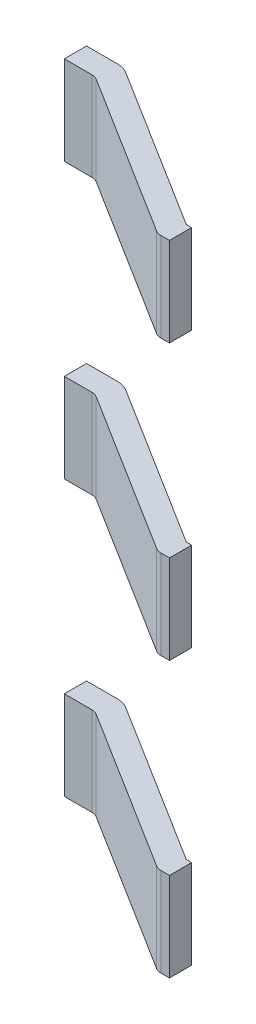
ISO-10303-21;
HEADER;
FILE_DESCRIPTION(('STEP AP214'),'2;1');
FILE_NAME('part.step','',(''),(''),'','','');
FILE_SCHEMA(('AUTOMOTIVE_DESIGN { 1 0 10303 214 1 1 1 1 }'));
ENDSEC;
DATA;
#1=APPLICATION_CONTEXT('core data for automotive mechanical design processes');
#2=APPLICATION_PROTOCOL_DEFINITION('international standard','automotive_design',2000,#1);
#3=PRODUCT_CONTEXT('',#1,'mechanical');
#4=PRODUCT('Part','Part','',(#3));
#5=PRODUCT_RELATED_PRODUCT_CATEGORY('part','',(#4));
#6=PRODUCT_DEFINITION_FORMATION('','',#4);
#7=PRODUCT_DEFINITION_CONTEXT('part definition',#1,'design');
#8=PRODUCT_DEFINITION('design','',#6,#7);
#9=PRODUCT_DEFINITION_SHAPE('','',#8);
#10=(LENGTH_UNIT() NAMED_UNIT(*) SI_UNIT(.MILLI.,.METRE.));
#11=(NAMED_UNIT(*) PLANE_ANGLE_UNIT() SI_UNIT($,.RADIAN.));
#12=(NAMED_UNIT(*) SI_UNIT($,.STERADIAN.) SOLID_ANGLE_UNIT());
#13=UNCERTAINTY_MEASURE_WITH_UNIT(LENGTH_MEASURE(1.E-05),#10,'distance_accuracy_value','');
#14=(GEOMETRIC_REPRESENTATION_CONTEXT(3) GLOBAL_UNCERTAINTY_ASSIGNED_CONTEXT((#13)) GLOBAL_UNIT_ASSIGNED_CONTEXT((#10,
#11,#12)) REPRESENTATION_CONTEXT('',''));
#15=CARTESIAN_POINT('',(0.,0.,0.));
#16=DIRECTION('',(0.,0.,1.));
#17=DIRECTION('',(1.,0.,0.));
#18=AXIS2_PLACEMENT_3D('',#15,#16,#17);
#19=CARTESIAN_POINT('',(-1.824104576066,1.92,0.964303036979));
#20=DIRECTION('',(0.,1.,0.));
#21=DIRECTION('',(-0.530661276733133,0.,0.847583983671212));
#22=AXIS2_PLACEMENT_3D('',#19,#20,#21);
#23=CYLINDRICAL_SURFACE('',#22,0.0925);
#24=CARTESIAN_POINT('',(-1.824104576066,1.92,0.964303036979));
#25=DIRECTION('',(0.,1.,0.));
#26=DIRECTION('',(0.,0.,1.));
#27=AXIS2_PLACEMENT_3D('',#24,#25,#26);
#28=CIRCLE('',#27,0.0925);
#29=CARTESIAN_POINT('',(-1.873190744164,1.92,1.042704555469));
#30=VERTEX_POINT('',#29);
#31=CARTESIAN_POINT('',(-1.824104576066,1.92,1.056803036979));
#32=VERTEX_POINT('',#31);
#33=EDGE_CURVE('P0_E228',#30,#32,#28,.T.);
#34=ORIENTED_EDGE('',*,*,#33,.T.);
#35=DIRECTION('',(0.,1.,0.));
#36=VECTOR('',#35,1.);
#37=CARTESIAN_POINT('',(-1.824104576066,1.92,1.056803036979));
#38=LINE('',#37,#36);
#39=CARTESIAN_POINT('',(-1.824104576066,2.66,1.056803036979));
#40=VERTEX_POINT('',#39);
#41=EDGE_CURVE('P0_E11',#32,#40,#38,.T.);
#42=ORIENTED_EDGE('',*,*,#41,.T.);
#43=CARTESIAN_POINT('',(-1.824104576066,2.66,0.964303036979));
#44=DIRECTION('',(0.,1.,0.));
#45=DIRECTION('',(0.,0.,1.));
#46=AXIS2_PLACEMENT_3D('',#43,#44,#45);
#47=CIRCLE('',#46,0.0925);
#48=CARTESIAN_POINT('',(-1.873190744164,2.66,1.042704555469));
#49=VERTEX_POINT('',#48);
#50=EDGE_CURVE('P0_E179',#49,#40,#47,.T.);
#51=ORIENTED_EDGE('',*,*,#50,.F.);
#52=DIRECTION('',(0.,1.,0.));
#53=VECTOR('',#52,1.);
#54=CARTESIAN_POINT('',(-1.873190744164,1.92,1.042704555469));
#55=LINE('',#54,#53);
#56=EDGE_CURVE('P0_E26',#30,#49,#55,.T.);
#57=ORIENTED_EDGE('',*,*,#56,.F.);
#58=EDGE_LOOP('',(#34,#42,#51,#57));
#59=FACE_BOUND('',#58,.T.);
#60=ADVANCED_FACE('P0_F17',(#59),#23,.T.);
#61=CARTESIAN_POINT('',(-1.850672336196,1.92,1.056803036979));
#62=DIRECTION('',(0.,0.,1.));
#63=DIRECTION('',(1.,0.,0.));
#64=AXIS2_PLACEMENT_3D('',#61,#62,#63);
#65=PLANE('',#64);
#66=DIRECTION('',(1.,0.,0.));
#67=VECTOR('',#66,1.);
#68=CARTESIAN_POINT('',(-1.850672336196,1.92,1.056803036979));
#69=LINE('',#68,#67);
#70=CARTESIAN_POINT('',(-1.7525,1.92,1.056803036979));
#71=VERTEX_POINT('',#70);
#72=EDGE_CURVE('P0_E227',#32,#71,#69,.T.);
#73=ORIENTED_EDGE('',*,*,#72,.T.);
#74=DIRECTION('',(0.,1.,0.));
#75=VECTOR('',#74,1.);
#76=CARTESIAN_POINT('',(-1.7525,1.92,1.056803036979));
#77=LINE('',#76,#75);
#78=CARTESIAN_POINT('',(-1.7525,2.66,1.056803036979));
#79=VERTEX_POINT('',#78);
#80=EDGE_CURVE('P0_E196',#71,#79,#77,.T.);
#81=ORIENTED_EDGE('',*,*,#80,.T.);
#82=DIRECTION('',(1.,0.,0.));
#83=VECTOR('',#82,1.);
#84=CARTESIAN_POINT('',(-1.850672336196,2.66,1.056803036979));
#85=LINE('',#84,#83);
#86=EDGE_CURVE('P0_E188',#40,#79,#85,.T.);
#87=ORIENTED_EDGE('',*,*,#86,.F.);
#88=ORIENTED_EDGE('',*,*,#41,.F.);
#89=EDGE_LOOP('',(#73,#81,#87,#88));
#90=FACE_BOUND('',#89,.T.);
#91=ADVANCED_FACE('P0_F19',(#90),#65,.T.);
#92=CARTESIAN_POINT('',(-3.288172336196,1.92,0.156803036979));
#93=DIRECTION('',(0.530661276733133,0.,-0.847583983671212));
#94=DIRECTION('',(0.,-1.,0.));
#95=AXIS2_PLACEMENT_3D('',#92,#93,#94);
#96=PLANE('',#95);
#97=ORIENTED_EDGE('',*,*,#56,.T.);
#98=DIRECTION('',(0.847583983671212,0.,0.530661276733133));
#99=VECTOR('',#98,1.);
#100=CARTESIAN_POINT('',(-3.288172336196,2.66,0.156803036979));
#101=LINE('',#100,#99);
#102=CARTESIAN_POINT('',(-3.220617112292,2.66,0.19909848151));
#103=VERTEX_POINT('',#102);
#104=EDGE_CURVE('P0_E175',#103,#49,#101,.T.);
#105=ORIENTED_EDGE('',*,*,#104,.F.);
#106=DIRECTION('',(0.,1.,0.));
#107=VECTOR('',#106,1.);
#108=CARTESIAN_POINT('',(-3.220617112292,1.92,0.19909848151));
#109=LINE('',#108,#107);
#110=CARTESIAN_POINT('',(-3.220617112292,1.92,0.19909848151));
#111=VERTEX_POINT('',#110);
#112=EDGE_CURVE('P0_E170',#111,#103,#109,.T.);
#113=ORIENTED_EDGE('',*,*,#112,.F.);
#114=DIRECTION('',(0.847583983671212,0.,0.530661276733133));
#115=VECTOR('',#114,1.);
#116=CARTESIAN_POINT('',(-3.288172336196,1.92,0.156803036979));
#117=LINE('',#116,#115);
#118=EDGE_CURVE('P0_E139',#111,#30,#117,.T.);
#119=ORIENTED_EDGE('',*,*,#118,.T.);
#120=EDGE_LOOP('',(#97,#105,#113,#119));
#121=FACE_BOUND('',#120,.T.);
#122=ADVANCED_FACE('P0_F281',(#121),#96,.F.);
#123=CARTESIAN_POINT('',(-1.7525,1.92,0.871803036979));
#124=DIRECTION('',(1.,0.,0.));
#125=DIRECTION('',(0.,1.,0.));
#126=AXIS2_PLACEMENT_3D('',#123,#124,#125);
#127=PLANE('',#126);
#128=DIRECTION('',(0.,0.,1.));
#129=VECTOR('',#128,1.);
#130=CARTESIAN_POINT('',(-1.7525,1.92,0.871803036979));
#131=LINE('',#130,#129);
#132=CARTESIAN_POINT('',(-1.7525,1.92,0.871803036979));
#133=VERTEX_POINT('',#132);
#134=EDGE_CURVE('P0_E223',#133,#71,#131,.T.);
#135=ORIENTED_EDGE('',*,*,#134,.F.);
#136=DIRECTION('',(0.,1.,0.));
#137=VECTOR('',#136,1.);
#138=CARTESIAN_POINT('',(-1.7525,1.92,0.871803036979));
#139=LINE('',#138,#137);
#140=CARTESIAN_POINT('',(-1.7525,2.66,0.871803036979));
#141=VERTEX_POINT('',#140);
#142=EDGE_CURVE('P0_E212',#133,#141,#139,.T.);
#143=ORIENTED_EDGE('',*,*,#142,.T.);
#144=DIRECTION('',(0.,0.,1.));
#145=VECTOR('',#144,1.);
#146=CARTESIAN_POINT('',(-1.7525,2.66,0.871803036979));
#147=LINE('',#146,#145);
#148=EDGE_CURVE('P0_E184',#141,#79,#147,.T.);
#149=ORIENTED_EDGE('',*,*,#148,.T.);
#150=ORIENTED_EDGE('',*,*,#80,.F.);
#151=EDGE_LOOP('',(#135,#143,#149,#150));
#152=FACE_BOUND('',#151,.T.);
#153=ADVANCED_FACE('P0_F243',(#152),#127,.T.);
#154=CARTESIAN_POINT('',(-1.850672336196,1.92,0.871803036979));
#155=DIRECTION('',(0.,0.,1.));
#156=DIRECTION('',(1.,0.,0.));
#157=AXIS2_PLACEMENT_3D('',#154,#155,#156);
#158=PLANE('',#157);
#159=ORIENTED_EDGE('',*,*,#142,.F.);
#160=DIRECTION('',(1.,0.,0.));
#161=VECTOR('',#160,1.);
#162=CARTESIAN_POINT('',(-1.850672336196,1.92,0.871803036979));
#163=LINE('',#162,#161);
#164=CARTESIAN_POINT('',(-1.797536815936,1.92,0.871803036979));
#165=VERTEX_POINT('',#164);
#166=EDGE_CURVE('P0_E219',#165,#133,#163,.T.);
#167=ORIENTED_EDGE('',*,*,#166,.F.);
#168=DIRECTION('',(0.,1.,0.));
#169=VECTOR('',#168,1.);
#170=CARTESIAN_POINT('',(-1.797536815936,1.92,0.871803036979));
#171=LINE('',#170,#169);
#172=CARTESIAN_POINT('',(-1.797536815936,2.66,0.871803036979));
#173=VERTEX_POINT('',#172);
#174=EDGE_CURVE('P0_E209',#165,#173,#171,.T.);
#175=ORIENTED_EDGE('',*,*,#174,.T.);
#176=DIRECTION('',(1.,0.,0.));
#177=VECTOR('',#176,1.);
#178=CARTESIAN_POINT('',(-1.850672336196,2.66,0.871803036979));
#179=LINE('',#178,#177);
#180=EDGE_CURVE('P0_E180',#173,#141,#179,.T.);
#181=ORIENTED_EDGE('',*,*,#180,.T.);
#182=EDGE_LOOP('',(#159,#167,#175,#181));
#183=FACE_BOUND('',#182,.T.);
#184=ADVANCED_FACE('P0_F362',(#183),#158,.F.);
#185=CARTESIAN_POINT('',(-3.19,1.92,0.));
#186=DIRECTION('',(0.530661276733133,0.,-0.847583983671212));
#187=DIRECTION('',(0.,-1.,0.));
#188=AXIS2_PLACEMENT_3D('',#185,#186,#187);
#189=PLANE('',#188);
#190=DIRECTION('',(0.847583983671212,0.,0.530661276733133));
#191=VECTOR('',#190,1.);
#192=CARTESIAN_POINT('',(-3.19,1.92,0.));
#193=LINE('',#192,#191);
#194=CARTESIAN_POINT('',(-3.144963184064,1.92,0.02819696302084));
#195=VERTEX_POINT('',#194);
#196=EDGE_CURVE('P0_E215',#195,#165,#193,.T.);
#197=ORIENTED_EDGE('',*,*,#196,.F.);
#198=DIRECTION('',(0.,1.,0.));
#199=VECTOR('',#198,1.);
#200=CARTESIAN_POINT('',(-3.144963184064,1.92,0.02819696302084));
#201=LINE('',#200,#199);
#202=CARTESIAN_POINT('',(-3.144963184064,2.66,0.02819696302084));
#203=VERTEX_POINT('',#202);
#204=EDGE_CURVE('P0_E138',#195,#203,#201,.T.);
#205=ORIENTED_EDGE('',*,*,#204,.T.);
#206=DIRECTION('',(0.847583983671212,0.,0.530661276733133));
#207=VECTOR('',#206,1.);
#208=CARTESIAN_POINT('',(-3.19,2.66,0.));
#209=LINE('',#208,#207);
#210=EDGE_CURVE('P0_E147',#203,#173,#209,.T.);
#211=ORIENTED_EDGE('',*,*,#210,.T.);
#212=ORIENTED_EDGE('',*,*,#174,.F.);
#213=EDGE_LOOP('',(#197,#205,#211,#212));
#214=FACE_BOUND('',#213,.T.);
#215=ADVANCED_FACE('P0_F352',(#214),#189,.T.);
#216=CARTESIAN_POINT('',(-3.24313552026,1.92,0.185));
#217=DIRECTION('',(0.,1.,0.));
#218=DIRECTION('',(0.,0.,-1.));
#219=AXIS2_PLACEMENT_3D('',#216,#217,#218);
#220=CYLINDRICAL_SURFACE('',#219,0.185);
#221=DIRECTION('',(0.,1.,0.));
#222=VECTOR('',#221,1.);
#223=CARTESIAN_POINT('',(-3.24313552026,1.92,0.));
#224=LINE('',#223,#222);
#225=CARTESIAN_POINT('',(-3.24313552026,1.92,0.));
#226=VERTEX_POINT('',#225);
#227=CARTESIAN_POINT('',(-3.24313552026,2.66,0.));
#228=VERTEX_POINT('',#227);
#229=EDGE_CURVE('P0_E127',#226,#228,#224,.T.);
#230=ORIENTED_EDGE('',*,*,#229,.T.);
#231=CARTESIAN_POINT('',(-3.24313552026,2.66,0.185));
#232=DIRECTION('',(0.,-1.,0.));
#233=DIRECTION('',(0.,0.,1.));
#234=AXIS2_PLACEMENT_3D('',#231,#232,#233);
#235=CIRCLE('',#234,0.185);
#236=EDGE_CURVE('P0_E130',#228,#203,#235,.T.);
#237=ORIENTED_EDGE('',*,*,#236,.T.);
#238=ORIENTED_EDGE('',*,*,#204,.F.);
#239=CARTESIAN_POINT('',(-3.24313552026,1.92,0.185));
#240=DIRECTION('',(0.,-1.,0.));
#241=DIRECTION('',(0.,0.,1.));
#242=AXIS2_PLACEMENT_3D('',#239,#240,#241);
#243=CIRCLE('',#242,0.185);
#244=EDGE_CURVE('P0_E133',#226,#195,#243,.T.);
#245=ORIENTED_EDGE('',*,*,#244,.F.);
#246=EDGE_LOOP('',(#230,#237,#238,#245));
#247=FACE_BOUND('',#246,.T.);
#248=ADVANCED_FACE('P0_F129',(#247),#220,.T.);
#249=CARTESIAN_POINT('',(-3.5,1.92,0.));
#250=DIRECTION('',(0.,0.,1.));
#251=DIRECTION('',(1.,0.,0.));
#252=AXIS2_PLACEMENT_3D('',#249,#250,#251);
#253=PLANE('',#252);
#254=ORIENTED_EDGE('',*,*,#229,.F.);
#255=DIRECTION('',(1.,0.,0.));
#256=VECTOR('',#255,1.);
#257=CARTESIAN_POINT('',(-3.5,1.92,0.));
#258=LINE('',#257,#256);
#259=CARTESIAN_POINT('',(-3.5,1.92,0.));
#260=VERTEX_POINT('',#259);
#261=EDGE_CURVE('P0_E208',#260,#226,#258,.T.);
#262=ORIENTED_EDGE('',*,*,#261,.F.);
#263=DIRECTION('',(0.,1.,0.));
#264=VECTOR('',#263,1.);
#265=CARTESIAN_POINT('',(-3.5,1.92,0.));
#266=LINE('',#265,#264);
#267=CARTESIAN_POINT('',(-3.5,2.66,0.));
#268=VERTEX_POINT('',#267);
#269=EDGE_CURVE('P0_E153',#260,#268,#266,.T.);
#270=ORIENTED_EDGE('',*,*,#269,.T.);
#271=DIRECTION('',(1.,0.,0.));
#272=VECTOR('',#271,1.);
#273=CARTESIAN_POINT('',(-3.5,2.66,0.));
#274=LINE('',#273,#272);
#275=EDGE_CURVE('P0_E144',#268,#228,#274,.T.);
#276=ORIENTED_EDGE('',*,*,#275,.T.);
#277=EDGE_LOOP('',(#254,#262,#270,#276));
#278=FACE_BOUND('',#277,.T.);
#279=ADVANCED_FACE('P0_F151',(#278),#253,.F.);
#280=CARTESIAN_POINT('',(-2.614100714426,1.92,0.486101794686));
#281=DIRECTION('',(0.,-1.,0.));
#282=DIRECTION('',(0.,0.,-1.));
#283=AXIS2_PLACEMENT_3D('',#280,#281,#282);
#284=PLANE('',#283);
#285=ORIENTED_EDGE('',*,*,#261,.T.);
#286=ORIENTED_EDGE('',*,*,#244,.T.);
#287=ORIENTED_EDGE('',*,*,#196,.T.);
#288=ORIENTED_EDGE('',*,*,#166,.T.);
#289=ORIENTED_EDGE('',*,*,#134,.T.);
#290=ORIENTED_EDGE('',*,*,#72,.F.);
#291=ORIENTED_EDGE('',*,*,#33,.F.);
#292=ORIENTED_EDGE('',*,*,#118,.F.);
#293=CARTESIAN_POINT('',(-3.269703280389,1.92,0.2775));
#294=DIRECTION('',(0.,-1.,0.));
#295=DIRECTION('',(0.,0.,1.));
#296=AXIS2_PLACEMENT_3D('',#293,#294,#295);
#297=CIRCLE('',#296,0.0925);
#298=CARTESIAN_POINT('',(-3.269703280389,1.92,0.185));
#299=VERTEX_POINT('',#298);
#300=EDGE_CURVE('P0_E149',#299,#111,#297,.T.);
#301=ORIENTED_EDGE('',*,*,#300,.F.);
#302=DIRECTION('',(1.,0.,0.));
#303=VECTOR('',#302,1.);
#304=CARTESIAN_POINT('',(-3.5,1.92,0.185));
#305=LINE('',#304,#303);
#306=CARTESIAN_POINT('',(-3.5,1.92,0.185));
#307=VERTEX_POINT('',#306);
#308=EDGE_CURVE('P0_E167',#307,#299,#305,.T.);
#309=ORIENTED_EDGE('',*,*,#308,.F.);
#310=DIRECTION('',(0.,0.,1.));
#311=VECTOR('',#310,1.);
#312=CARTESIAN_POINT('',(-3.5,1.92,0.));
#313=LINE('',#312,#311);
#314=EDGE_CURVE('P0_E205',#260,#307,#313,.T.);
#315=ORIENTED_EDGE('',*,*,#314,.F.);
#316=EDGE_LOOP('',(#285,#286,#287,#288,#289,#290,#291,#292,#301,#309,#315));
#317=FACE_BOUND('',#316,.T.);
#318=ADVANCED_FACE('P0_F247',(#317),#284,.T.);
#319=CARTESIAN_POINT('',(-3.5,1.92,0.));
#320=DIRECTION('',(1.,0.,0.));
#321=DIRECTION('',(0.,1.,0.));
#322=AXIS2_PLACEMENT_3D('',#319,#320,#321);
#323=PLANE('',#322);
#324=DIRECTION('',(0.,1.,0.));
#325=VECTOR('',#324,1.);
#326=CARTESIAN_POINT('',(-3.5,1.92,0.185));
#327=LINE('',#326,#325);
#328=CARTESIAN_POINT('',(-3.5,2.66,0.185));
#329=VERTEX_POINT('',#328);
#330=EDGE_CURVE('P0_E258',#307,#329,#327,.T.);
#331=ORIENTED_EDGE('',*,*,#330,.T.);
#332=DIRECTION('',(0.,0.,1.));
#333=VECTOR('',#332,1.);
#334=CARTESIAN_POINT('',(-3.5,2.66,0.));
#335=LINE('',#334,#333);
#336=EDGE_CURVE('P0_E156',#268,#329,#335,.T.);
#337=ORIENTED_EDGE('',*,*,#336,.F.);
#338=ORIENTED_EDGE('',*,*,#269,.F.);
#339=ORIENTED_EDGE('',*,*,#314,.T.);
#340=EDGE_LOOP('',(#331,#337,#338,#339));
#341=FACE_BOUND('',#340,.T.);
#342=ADVANCED_FACE('P0_F283',(#341),#323,.F.);
#343=CARTESIAN_POINT('',(-3.269703280389,1.92,0.2775));
#344=DIRECTION('',(0.,1.,0.));
#345=DIRECTION('',(0.,0.,-1.));
#346=AXIS2_PLACEMENT_3D('',#343,#344,#345);
#347=CYLINDRICAL_SURFACE('',#346,0.0925);
#348=ORIENTED_EDGE('',*,*,#300,.T.);
#349=ORIENTED_EDGE('',*,*,#112,.T.);
#350=CARTESIAN_POINT('',(-3.269703280389,2.66,0.2775));
#351=DIRECTION('',(0.,-1.,0.));
#352=DIRECTION('',(0.,0.,1.));
#353=AXIS2_PLACEMENT_3D('',#350,#351,#352);
#354=CIRCLE('',#353,0.0925);
#355=CARTESIAN_POINT('',(-3.269703280389,2.66,0.185));
#356=VERTEX_POINT('',#355);
#357=EDGE_CURVE('P0_E164',#356,#103,#354,.T.);
#358=ORIENTED_EDGE('',*,*,#357,.F.);
#359=DIRECTION('',(0.,1.,0.));
#360=VECTOR('',#359,1.);
#361=CARTESIAN_POINT('',(-3.269703280389,1.92,0.185));
#362=LINE('',#361,#360);
#363=EDGE_CURVE('P0_E157',#299,#356,#362,.T.);
#364=ORIENTED_EDGE('',*,*,#363,.F.);
#365=EDGE_LOOP('',(#348,#349,#358,#364));
#366=FACE_BOUND('',#365,.T.);
#367=ADVANCED_FACE('P0_F277',(#366),#347,.F.);
#368=CARTESIAN_POINT('',(-2.614100714426,2.66,0.486101794686));
#369=DIRECTION('',(0.,1.,0.));
#370=DIRECTION('',(0.,0.,-1.));
#371=AXIS2_PLACEMENT_3D('',#368,#369,#370);
#372=PLANE('',#371);
#373=ORIENTED_EDGE('',*,*,#275,.F.);
#374=ORIENTED_EDGE('',*,*,#336,.T.);
#375=DIRECTION('',(1.,0.,0.));
#376=VECTOR('',#375,1.);
#377=CARTESIAN_POINT('',(-3.5,2.66,0.185));
#378=LINE('',#377,#376);
#379=EDGE_CURVE('P0_E254',#329,#356,#378,.T.);
#380=ORIENTED_EDGE('',*,*,#379,.T.);
#381=ORIENTED_EDGE('',*,*,#357,.T.);
#382=ORIENTED_EDGE('',*,*,#104,.T.);
#383=ORIENTED_EDGE('',*,*,#50,.T.);
#384=ORIENTED_EDGE('',*,*,#86,.T.);
#385=ORIENTED_EDGE('',*,*,#148,.F.);
#386=ORIENTED_EDGE('',*,*,#180,.F.);
#387=ORIENTED_EDGE('',*,*,#210,.F.);
#388=ORIENTED_EDGE('',*,*,#236,.F.);
#389=EDGE_LOOP('',(#373,#374,#380,#381,#382,#383,#384,#385,#386,#387,#388));
#390=FACE_BOUND('',#389,.T.);
#391=ADVANCED_FACE('P0_F143',(#390),#372,.T.);
#392=CARTESIAN_POINT('',(-3.5,1.92,0.185));
#393=DIRECTION('',(0.,0.,1.));
#394=DIRECTION('',(1.,0.,0.));
#395=AXIS2_PLACEMENT_3D('',#392,#393,#394);
#396=PLANE('',#395);
#397=ORIENTED_EDGE('',*,*,#379,.F.);
#398=ORIENTED_EDGE('',*,*,#330,.F.);
#399=ORIENTED_EDGE('',*,*,#308,.T.);
#400=ORIENTED_EDGE('',*,*,#363,.T.);
#401=EDGE_LOOP('',(#397,#398,#399,#400));
#402=FACE_BOUND('',#401,.T.);
#403=ADVANCED_FACE('P0_F273',(#402),#396,.T.);
#404=CLOSED_SHELL('',(#60,#91,#122,#153,#184,#215,#248,#279,#318,#342,#367,#391,#403));
#405=MANIFOLD_SOLID_BREP('P0_B1',#404);
#406=CARTESIAN_POINT('',(-1.824104576066,-0.37,0.964303036979));
#407=DIRECTION('',(0.,1.,0.));
#408=DIRECTION('',(-0.530661276733133,0.,0.847583983671212));
#409=AXIS2_PLACEMENT_3D('',#406,#407,#408);
#410=CYLINDRICAL_SURFACE('',#409,0.0925);
#411=CARTESIAN_POINT('',(-1.824104576066,-0.37,0.964303036979));
#412=DIRECTION('',(0.,1.,0.));
#413=DIRECTION('',(0.,0.,1.));
#414=AXIS2_PLACEMENT_3D('',#411,#412,#413);
#415=CIRCLE('',#414,0.0925);
#416=CARTESIAN_POINT('',(-1.873190744164,-0.37,1.042704555469));
#417=VERTEX_POINT('',#416);
#418=CARTESIAN_POINT('',(-1.824104576066,-0.37,1.056803036979));
#419=VERTEX_POINT('',#418);
#420=EDGE_CURVE('P1_E240',#417,#419,#415,.T.);
#421=ORIENTED_EDGE('',*,*,#420,.T.);
#422=DIRECTION('',(0.,1.,0.));
#423=VECTOR('',#422,1.);
#424=CARTESIAN_POINT('',(-1.824104576066,-0.37,1.056803036979));
#425=LINE('',#424,#423);
#426=CARTESIAN_POINT('',(-1.824104576066,0.37,1.056803036979));
#427=VERTEX_POINT('',#426);
#428=EDGE_CURVE('P1_E11',#419,#427,#425,.T.);
#429=ORIENTED_EDGE('',*,*,#428,.T.);
#430=CARTESIAN_POINT('',(-1.824104576066,0.37,0.964303036979));
#431=DIRECTION('',(0.,1.,0.));
#432=DIRECTION('',(0.,0.,1.));
#433=AXIS2_PLACEMENT_3D('',#430,#431,#432);
#434=CIRCLE('',#433,0.0925);
#435=CARTESIAN_POINT('',(-1.873190744164,0.37,1.042704555469));
#436=VERTEX_POINT('',#435);
#437=EDGE_CURVE('P1_E187',#436,#427,#434,.T.);
#438=ORIENTED_EDGE('',*,*,#437,.F.);
#439=DIRECTION('',(0.,1.,0.));
#440=VECTOR('',#439,1.);
#441=CARTESIAN_POINT('',(-1.873190744164,-0.37,1.042704555469));
#442=LINE('',#441,#440);
#443=EDGE_CURVE('P1_E26',#417,#436,#442,.T.);
#444=ORIENTED_EDGE('',*,*,#443,.F.);
#445=EDGE_LOOP('',(#421,#429,#438,#444));
#446=FACE_BOUND('',#445,.T.);
#447=ADVANCED_FACE('P1_F17',(#446),#410,.T.);
#448=CARTESIAN_POINT('',(-1.850672336196,-0.37,1.056803036979));
#449=DIRECTION('',(0.,0.,1.));
#450=DIRECTION('',(1.,0.,0.));
#451=AXIS2_PLACEMENT_3D('',#448,#449,#450);
#452=PLANE('',#451);
#453=DIRECTION('',(1.,0.,0.));
#454=VECTOR('',#453,1.);
#455=CARTESIAN_POINT('',(-1.850672336196,-0.37,1.056803036979));
#456=LINE('',#455,#454);
#457=CARTESIAN_POINT('',(-1.7525,-0.37,1.056803036979));
#458=VERTEX_POINT('',#457);
#459=EDGE_CURVE('P1_E237',#419,#458,#456,.T.);
#460=ORIENTED_EDGE('',*,*,#459,.T.);
#461=DIRECTION('',(0.,1.,0.));
#462=VECTOR('',#461,1.);
#463=CARTESIAN_POINT('',(-1.7525,-0.37,1.056803036979));
#464=LINE('',#463,#462);
#465=CARTESIAN_POINT('',(-1.7525,0.37,1.056803036979));
#466=VERTEX_POINT('',#465);
#467=EDGE_CURVE('P1_E204',#458,#466,#464,.T.);
#468=ORIENTED_EDGE('',*,*,#467,.T.);
#469=DIRECTION('',(1.,0.,0.));
#470=VECTOR('',#469,1.);
#471=CARTESIAN_POINT('',(-1.850672336196,0.37,1.056803036979));
#472=LINE('',#471,#470);
#473=EDGE_CURVE('P1_E201',#427,#466,#472,.T.);
#474=ORIENTED_EDGE('',*,*,#473,.F.);
#475=ORIENTED_EDGE('',*,*,#428,.F.);
#476=EDGE_LOOP('',(#460,#468,#474,#475));
#477=FACE_BOUND('',#476,.T.);
#478=ADVANCED_FACE('P1_F19',(#477),#452,.T.);
#479=CARTESIAN_POINT('',(-3.288172336196,-0.37,0.156803036979));
#480=DIRECTION('',(0.530661276733133,0.,-0.847583983671212));
#481=DIRECTION('',(0.,-1.,0.));
#482=AXIS2_PLACEMENT_3D('',#479,#480,#481);
#483=PLANE('',#482);
#484=ORIENTED_EDGE('',*,*,#443,.T.);
#485=DIRECTION('',(0.847583983671212,0.,0.530661276733133));
#486=VECTOR('',#485,1.);
#487=CARTESIAN_POINT('',(-3.288172336196,0.37,0.156803036979));
#488=LINE('',#487,#486);
#489=CARTESIAN_POINT('',(-3.220617112292,0.37,0.19909848151));
#490=VERTEX_POINT('',#489);
#491=EDGE_CURVE('P1_E179',#490,#436,#488,.T.);
#492=ORIENTED_EDGE('',*,*,#491,.F.);
#493=DIRECTION('',(0.,1.,0.));
#494=VECTOR('',#493,1.);
#495=CARTESIAN_POINT('',(-3.220617112292,-0.37,0.19909848151));
#496=LINE('',#495,#494);
#497=CARTESIAN_POINT('',(-3.220617112292,-0.37,0.19909848151));
#498=VERTEX_POINT('',#497);
#499=EDGE_CURVE('P1_E197',#498,#490,#496,.T.);
#500=ORIENTED_EDGE('',*,*,#499,.F.);
#501=DIRECTION('',(0.847583983671212,0.,0.530661276733133));
#502=VECTOR('',#501,1.);
#503=CARTESIAN_POINT('',(-3.288172336196,-0.37,0.156803036979));
#504=LINE('',#503,#502);
#505=EDGE_CURVE('P1_E243',#498,#417,#504,.T.);
#506=ORIENTED_EDGE('',*,*,#505,.T.);
#507=EDGE_LOOP('',(#484,#492,#500,#506));
#508=FACE_BOUND('',#507,.T.);
#509=ADVANCED_FACE('P1_F283',(#508),#483,.F.);
#510=CARTESIAN_POINT('',(-1.7525,-0.37,0.871803036979));
#511=DIRECTION('',(1.,0.,0.));
#512=DIRECTION('',(0.,1.,0.));
#513=AXIS2_PLACEMENT_3D('',#510,#511,#512);
#514=PLANE('',#513);
#515=DIRECTION('',(0.,0.,1.));
#516=VECTOR('',#515,1.);
#517=CARTESIAN_POINT('',(-1.7525,-0.37,0.871803036979));
#518=LINE('',#517,#516);
#519=CARTESIAN_POINT('',(-1.7525,-0.37,0.871803036979));
#520=VERTEX_POINT('',#519);
#521=EDGE_CURVE('P1_E233',#520,#458,#518,.T.);
#522=ORIENTED_EDGE('',*,*,#521,.F.);
#523=DIRECTION('',(0.,1.,0.));
#524=VECTOR('',#523,1.);
#525=CARTESIAN_POINT('',(-1.7525,-0.37,0.871803036979));
#526=LINE('',#525,#524);
#527=CARTESIAN_POINT('',(-1.7525,0.37,0.871803036979));
#528=VERTEX_POINT('',#527);
#529=EDGE_CURVE('P1_E250',#520,#528,#526,.T.);
#530=ORIENTED_EDGE('',*,*,#529,.T.);
#531=DIRECTION('',(0.,0.,1.));
#532=VECTOR('',#531,1.);
#533=CARTESIAN_POINT('',(-1.7525,0.37,0.871803036979));
#534=LINE('',#533,#532);
#535=EDGE_CURVE('P1_E164',#528,#466,#534,.T.);
#536=ORIENTED_EDGE('',*,*,#535,.T.);
#537=ORIENTED_EDGE('',*,*,#467,.F.);
#538=EDGE_LOOP('',(#522,#530,#536,#537));
#539=FACE_BOUND('',#538,.T.);
#540=ADVANCED_FACE('P1_F260',(#539),#514,.T.);
#541=CARTESIAN_POINT('',(-1.850672336196,-0.37,0.871803036979));
#542=DIRECTION('',(0.,0.,1.));
#543=DIRECTION('',(1.,0.,0.));
#544=AXIS2_PLACEMENT_3D('',#541,#542,#543);
#545=PLANE('',#544);
#546=ORIENTED_EDGE('',*,*,#529,.F.);
#547=DIRECTION('',(1.,0.,0.));
#548=VECTOR('',#547,1.);
#549=CARTESIAN_POINT('',(-1.850672336196,-0.37,0.871803036979));
#550=LINE('',#549,#548);
#551=CARTESIAN_POINT('',(-1.797536815936,-0.37,0.871803036979));
#552=VERTEX_POINT('',#551);
#553=EDGE_CURVE('P1_E229',#552,#520,#550,.T.);
#554=ORIENTED_EDGE('',*,*,#553,.F.);
#555=DIRECTION('',(0.,1.,0.));
#556=VECTOR('',#555,1.);
#557=CARTESIAN_POINT('',(-1.797536815936,-0.37,0.871803036979));
#558=LINE('',#557,#556);
#559=CARTESIAN_POINT('',(-1.797536815936,0.37,0.871803036979));
#560=VERTEX_POINT('',#559);
#561=EDGE_CURVE('P1_E224',#552,#560,#558,.T.);
#562=ORIENTED_EDGE('',*,*,#561,.T.);
#563=DIRECTION('',(1.,0.,0.));
#564=VECTOR('',#563,1.);
#565=CARTESIAN_POINT('',(-1.850672336196,0.37,0.871803036979));
#566=LINE('',#565,#564);
#567=EDGE_CURVE('P1_E169',#560,#528,#566,.T.);
#568=ORIENTED_EDGE('',*,*,#567,.T.);
#569=EDGE_LOOP('',(#546,#554,#562,#568));
#570=FACE_BOUND('',#569,.T.);
#571=ADVANCED_FACE('P1_F270',(#570),#545,.F.);
#572=CARTESIAN_POINT('',(-3.19,-0.37,0.));
#573=DIRECTION('',(0.530661276733133,0.,-0.847583983671212));
#574=DIRECTION('',(0.,-1.,0.));
#575=AXIS2_PLACEMENT_3D('',#572,#573,#574);
#576=PLANE('',#575);
#577=DIRECTION('',(0.847583983671212,0.,0.530661276733133));
#578=VECTOR('',#577,1.);
#579=CARTESIAN_POINT('',(-3.19,-0.37,0.));
#580=LINE('',#579,#578);
#581=CARTESIAN_POINT('',(-3.144963184064,-0.37,0.02819696302084));
#582=VERTEX_POINT('',#581);
#583=EDGE_CURVE('P1_E192',#582,#552,#580,.T.);
#584=ORIENTED_EDGE('',*,*,#583,.F.);
#585=DIRECTION('',(0.,1.,0.));
#586=VECTOR('',#585,1.);
#587=CARTESIAN_POINT('',(-3.144963184064,-0.37,0.02819696302084));
#588=LINE('',#587,#586);
#589=CARTESIAN_POINT('',(-3.144963184064,0.37,0.02819696302084));
#590=VERTEX_POINT('',#589);
#591=EDGE_CURVE('P1_E221',#582,#590,#588,.T.);
#592=ORIENTED_EDGE('',*,*,#591,.T.);
#593=DIRECTION('',(0.847583983671212,0.,0.530661276733133));
#594=VECTOR('',#593,1.);
#595=CARTESIAN_POINT('',(-3.19,0.37,0.));
#596=LINE('',#595,#594);
#597=EDGE_CURVE('P1_E165',#590,#560,#596,.T.);
#598=ORIENTED_EDGE('',*,*,#597,.T.);
#599=ORIENTED_EDGE('',*,*,#561,.F.);
#600=EDGE_LOOP('',(#584,#592,#598,#599));
#601=FACE_BOUND('',#600,.T.);
#602=ADVANCED_FACE('P1_F273',(#601),#576,.T.);
#603=CARTESIAN_POINT('',(-3.24313552026,-0.37,0.185));
#604=DIRECTION('',(0.,1.,0.));
#605=DIRECTION('',(0.,0.,-1.));
#606=AXIS2_PLACEMENT_3D('',#603,#604,#605);
#607=CYLINDRICAL_SURFACE('',#606,0.185);
#608=DIRECTION('',(0.,1.,0.));
#609=VECTOR('',#608,1.);
#610=CARTESIAN_POINT('',(-3.24313552026,-0.37,0.));
#611=LINE('',#610,#609);
#612=CARTESIAN_POINT('',(-3.24313552026,-0.37,0.));
#613=VERTEX_POINT('',#612);
#614=CARTESIAN_POINT('',(-3.24313552026,0.37,0.));
#615=VERTEX_POINT('',#614);
#616=EDGE_CURVE('P1_E225',#613,#615,#611,.T.);
#617=ORIENTED_EDGE('',*,*,#616,.T.);
#618=CARTESIAN_POINT('',(-3.24313552026,0.37,0.185));
#619=DIRECTION('',(0.,-1.,0.));
#620=DIRECTION('',(0.,0.,1.));
#621=AXIS2_PLACEMENT_3D('',#618,#619,#620);
#622=CIRCLE('',#621,0.185);
#623=EDGE_CURVE('P1_E168',#615,#590,#622,.T.);
#624=ORIENTED_EDGE('',*,*,#623,.T.);
#625=ORIENTED_EDGE('',*,*,#591,.F.);
#626=CARTESIAN_POINT('',(-3.24313552026,-0.37,0.185));
#627=DIRECTION('',(0.,-1.,0.));
#628=DIRECTION('',(0.,0.,1.));
#629=AXIS2_PLACEMENT_3D('',#626,#627,#628);
#630=CIRCLE('',#629,0.185);
#631=EDGE_CURVE('P1_E188',#613,#582,#630,.T.);
#632=ORIENTED_EDGE('',*,*,#631,.F.);
#633=EDGE_LOOP('',(#617,#624,#625,#632));
#634=FACE_BOUND('',#633,.T.);
#635=ADVANCED_FACE('P1_F276',(#634),#607,.T.);
#636=CARTESIAN_POINT('',(-3.5,-0.37,0.));
#637=DIRECTION('',(0.,0.,1.));
#638=DIRECTION('',(1.,0.,0.));
#639=AXIS2_PLACEMENT_3D('',#636,#637,#638);
#640=PLANE('',#639);
#641=ORIENTED_EDGE('',*,*,#616,.F.);
#642=DIRECTION('',(1.,0.,0.));
#643=VECTOR('',#642,1.);
#644=CARTESIAN_POINT('',(-3.5,-0.37,0.));
#645=LINE('',#644,#643);
#646=CARTESIAN_POINT('',(-3.5,-0.37,0.));
#647=VERTEX_POINT('',#646);
#648=EDGE_CURVE('P1_E193',#647,#613,#645,.T.);
#649=ORIENTED_EDGE('',*,*,#648,.F.);
#650=DIRECTION('',(0.,1.,0.));
#651=VECTOR('',#650,1.);
#652=CARTESIAN_POINT('',(-3.5,-0.37,0.));
#653=LINE('',#652,#651);
#654=CARTESIAN_POINT('',(-3.5,0.37,0.));
#655=VERTEX_POINT('',#654);
#656=EDGE_CURVE('P1_E213',#647,#655,#653,.T.);
#657=ORIENTED_EDGE('',*,*,#656,.T.);
#658=DIRECTION('',(1.,0.,0.));
#659=VECTOR('',#658,1.);
#660=CARTESIAN_POINT('',(-3.5,0.37,0.));
#661=LINE('',#660,#659);
#662=EDGE_CURVE('P1_E136',#655,#615,#661,.T.);
#663=ORIENTED_EDGE('',*,*,#662,.T.);
#664=EDGE_LOOP('',(#641,#649,#657,#663));
#665=FACE_BOUND('',#664,.T.);
#666=ADVANCED_FACE('P1_F278',(#665),#640,.F.);
#667=CARTESIAN_POINT('',(-2.614100714426,-0.37,0.486101794686));
#668=DIRECTION('',(0.,-1.,0.));
#669=DIRECTION('',(0.,0.,-1.));
#670=AXIS2_PLACEMENT_3D('',#667,#668,#669);
#671=PLANE('',#670);
#672=ORIENTED_EDGE('',*,*,#648,.T.);
#673=ORIENTED_EDGE('',*,*,#631,.T.);
#674=ORIENTED_EDGE('',*,*,#583,.T.);
#675=ORIENTED_EDGE('',*,*,#553,.T.);
#676=ORIENTED_EDGE('',*,*,#521,.T.);
#677=ORIENTED_EDGE('',*,*,#459,.F.);
#678=ORIENTED_EDGE('',*,*,#420,.F.);
#679=ORIENTED_EDGE('',*,*,#505,.F.);
#680=CARTESIAN_POINT('',(-3.269703280389,-0.37,0.2775));
#681=DIRECTION('',(0.,-1.,0.));
#682=DIRECTION('',(0.,0.,1.));
#683=AXIS2_PLACEMENT_3D('',#680,#681,#682);
#684=CIRCLE('',#683,0.0925);
#685=CARTESIAN_POINT('',(-3.269703280389,-0.37,0.185));
#686=VERTEX_POINT('',#685);
#687=EDGE_CURVE('P1_E183',#686,#498,#684,.T.);
#688=ORIENTED_EDGE('',*,*,#687,.F.);
#689=DIRECTION('',(1.,0.,0.));
#690=VECTOR('',#689,1.);
#691=CARTESIAN_POINT('',(-3.5,-0.37,0.185));
#692=LINE('',#691,#690);
#693=CARTESIAN_POINT('',(-3.5,-0.37,0.185));
#694=VERTEX_POINT('',#693);
#695=EDGE_CURVE('P1_E151',#694,#686,#692,.T.);
#696=ORIENTED_EDGE('',*,*,#695,.F.);
#697=DIRECTION('',(0.,0.,1.));
#698=VECTOR('',#697,1.);
#699=CARTESIAN_POINT('',(-3.5,-0.37,0.));
#700=LINE('',#699,#698);
#701=EDGE_CURVE('P1_E146',#647,#694,#700,.T.);
#702=ORIENTED_EDGE('',*,*,#701,.F.);
#703=EDGE_LOOP('',(#672,#673,#674,#675,#676,#677,#678,#679,#688,#696,#702));
#704=FACE_BOUND('',#703,.T.);
#705=ADVANCED_FACE('P1_F266',(#704),#671,.T.);
#706=CARTESIAN_POINT('',(-3.5,-0.37,0.));
#707=DIRECTION('',(1.,0.,0.));
#708=DIRECTION('',(0.,1.,0.));
#709=AXIS2_PLACEMENT_3D('',#706,#707,#708);
#710=PLANE('',#709);
#711=DIRECTION('',(0.,1.,0.));
#712=VECTOR('',#711,1.);
#713=CARTESIAN_POINT('',(-3.5,-0.37,0.185));
#714=LINE('',#713,#712);
#715=CARTESIAN_POINT('',(-3.5,0.37,0.185));
#716=VERTEX_POINT('',#715);
#717=EDGE_CURVE('P1_E143',#694,#716,#714,.T.);
#718=ORIENTED_EDGE('',*,*,#717,.T.);
#719=DIRECTION('',(0.,0.,1.));
#720=VECTOR('',#719,1.);
#721=CARTESIAN_POINT('',(-3.5,0.37,0.));
#722=LINE('',#721,#720);
#723=EDGE_CURVE('P1_E128',#655,#716,#722,.T.);
#724=ORIENTED_EDGE('',*,*,#723,.F.);
#725=ORIENTED_EDGE('',*,*,#656,.F.);
#726=ORIENTED_EDGE('',*,*,#701,.T.);
#727=EDGE_LOOP('',(#718,#724,#725,#726));
#728=FACE_BOUND('',#727,.T.);
#729=ADVANCED_FACE('P1_F144',(#728),#710,.F.);
#730=CARTESIAN_POINT('',(-3.269703280389,-0.37,0.2775));
#731=DIRECTION('',(0.,1.,0.));
#732=DIRECTION('',(0.,0.,-1.));
#733=AXIS2_PLACEMENT_3D('',#730,#731,#732);
#734=CYLINDRICAL_SURFACE('',#733,0.0925);
#735=ORIENTED_EDGE('',*,*,#687,.T.);
#736=ORIENTED_EDGE('',*,*,#499,.T.);
#737=CARTESIAN_POINT('',(-3.269703280389,0.37,0.2775));
#738=DIRECTION('',(0.,-1.,0.));
#739=DIRECTION('',(0.,0.,1.));
#740=AXIS2_PLACEMENT_3D('',#737,#738,#739);
#741=CIRCLE('',#740,0.0925);
#742=CARTESIAN_POINT('',(-3.269703280389,0.37,0.185));
#743=VERTEX_POINT('',#742);
#744=EDGE_CURVE('P1_E140',#743,#490,#741,.T.);
#745=ORIENTED_EDGE('',*,*,#744,.F.);
#746=DIRECTION('',(0.,1.,0.));
#747=VECTOR('',#746,1.);
#748=CARTESIAN_POINT('',(-3.269703280389,-0.37,0.185));
#749=LINE('',#748,#747);
#750=EDGE_CURVE('P1_E156',#686,#743,#749,.T.);
#751=ORIENTED_EDGE('',*,*,#750,.F.);
#752=EDGE_LOOP('',(#735,#736,#745,#751));
#753=FACE_BOUND('',#752,.T.);
#754=ADVANCED_FACE('P1_F281',(#753),#734,.F.);
#755=CARTESIAN_POINT('',(-2.614100714426,0.37,0.486101794686));
#756=DIRECTION('',(0.,1.,0.));
#757=DIRECTION('',(0.,0.,-1.));
#758=AXIS2_PLACEMENT_3D('',#755,#756,#757);
#759=PLANE('',#758);
#760=ORIENTED_EDGE('',*,*,#662,.F.);
#761=ORIENTED_EDGE('',*,*,#723,.T.);
#762=DIRECTION('',(1.,0.,0.));
#763=VECTOR('',#762,1.);
#764=CARTESIAN_POINT('',(-3.5,0.37,0.185));
#765=LINE('',#764,#763);
#766=EDGE_CURVE('P1_E133',#716,#743,#765,.T.);
#767=ORIENTED_EDGE('',*,*,#766,.T.);
#768=ORIENTED_EDGE('',*,*,#744,.T.);
#769=ORIENTED_EDGE('',*,*,#491,.T.);
#770=ORIENTED_EDGE('',*,*,#437,.T.);
#771=ORIENTED_EDGE('',*,*,#473,.T.);
#772=ORIENTED_EDGE('',*,*,#535,.F.);
#773=ORIENTED_EDGE('',*,*,#567,.F.);
#774=ORIENTED_EDGE('',*,*,#597,.F.);
#775=ORIENTED_EDGE('',*,*,#623,.F.);
#776=EDGE_LOOP('',(#760,#761,#767,#768,#769,#770,#771,#772,#773,#774,#775));
#777=FACE_BOUND('',#776,.T.);
#778=ADVANCED_FACE('P1_F130',(#777),#759,.T.);
#779=CARTESIAN_POINT('',(-3.5,-0.37,0.185));
#780=DIRECTION('',(0.,0.,1.));
#781=DIRECTION('',(1.,0.,0.));
#782=AXIS2_PLACEMENT_3D('',#779,#780,#781);
#783=PLANE('',#782);
#784=ORIENTED_EDGE('',*,*,#766,.F.);
#785=ORIENTED_EDGE('',*,*,#717,.F.);
#786=ORIENTED_EDGE('',*,*,#695,.T.);
#787=ORIENTED_EDGE('',*,*,#750,.T.);
#788=EDGE_LOOP('',(#784,#785,#786,#787));
#789=FACE_BOUND('',#788,.T.);
#790=ADVANCED_FACE('P1_F154',(#789),#783,.T.);
#791=CLOSED_SHELL('',(#447,#478,#509,#540,#571,#602,#635,#666,#705,#729,#754,#778,#790));
#792=MANIFOLD_SOLID_BREP('P1_B1',#791);
#793=CARTESIAN_POINT('',(-1.824104576066,-2.66,0.964303036979));
#794=DIRECTION('',(0.,1.,0.));
#795=DIRECTION('',(-0.530661276733133,0.,0.847583983671212));
#796=AXIS2_PLACEMENT_3D('',#793,#794,#795);
#797=CYLINDRICAL_SURFACE('',#796,0.0925);
#798=CARTESIAN_POINT('',(-1.824104576066,-2.66,0.964303036979));
#799=DIRECTION('',(0.,1.,0.));
#800=DIRECTION('',(0.,0.,1.));
#801=AXIS2_PLACEMENT_3D('',#798,#799,#800);
#802=CIRCLE('',#801,0.0925);
#803=CARTESIAN_POINT('',(-1.873190744164,-2.66,1.042704555469));
#804=VERTEX_POINT('',#803);
#805=CARTESIAN_POINT('',(-1.824104576066,-2.66,1.056803036979));
#806=VERTEX_POINT('',#805);
#807=EDGE_CURVE('P2_E233',#804,#806,#802,.T.);
#808=ORIENTED_EDGE('',*,*,#807,.T.);
#809=DIRECTION('',(0.,1.,0.));
#810=VECTOR('',#809,1.);
#811=CARTESIAN_POINT('',(-1.824104576066,-2.66,1.056803036979));
#812=LINE('',#811,#810);
#813=CARTESIAN_POINT('',(-1.824104576066,-1.92,1.056803036979));
#814=VERTEX_POINT('',#813);
#815=EDGE_CURVE('P2_E11',#806,#814,#812,.T.);
#816=ORIENTED_EDGE('',*,*,#815,.T.);
#817=CARTESIAN_POINT('',(-1.824104576066,-1.92,0.964303036979));
#818=DIRECTION('',(0.,1.,0.));
#819=DIRECTION('',(0.,0.,1.));
#820=AXIS2_PLACEMENT_3D('',#817,#818,#819);
#821=CIRCLE('',#820,0.0925);
#822=CARTESIAN_POINT('',(-1.873190744164,-1.92,1.042704555469));
#823=VERTEX_POINT('',#822);
#824=EDGE_CURVE('P2_E190',#823,#814,#821,.T.);
#825=ORIENTED_EDGE('',*,*,#824,.F.);
#826=DIRECTION('',(0.,1.,0.));
#827=VECTOR('',#826,1.);
#828=CARTESIAN_POINT('',(-1.873190744164,-2.66,1.042704555469));
#829=LINE('',#828,#827);
#830=EDGE_CURVE('P2_E20',#804,#823,#829,.T.);
#831=ORIENTED_EDGE('',*,*,#830,.F.);
#832=EDGE_LOOP('',(#808,#816,#825,#831));
#833=FACE_BOUND('',#832,.T.);
#834=ADVANCED_FACE('P2_F17',(#833),#797,.T.);
#835=CARTESIAN_POINT('',(-1.850672336196,-2.66,1.056803036979));
#836=DIRECTION('',(0.,0.,1.));
#837=DIRECTION('',(1.,0.,0.));
#838=AXIS2_PLACEMENT_3D('',#835,#836,#837);
#839=PLANE('',#838);
#840=DIRECTION('',(1.,0.,0.));
#841=VECTOR('',#840,1.);
#842=CARTESIAN_POINT('',(-1.850672336196,-2.66,1.056803036979));
#843=LINE('',#842,#841);
#844=CARTESIAN_POINT('',(-1.7525,-2.66,1.056803036979));
#845=VERTEX_POINT('',#844);
#846=EDGE_CURVE('P2_E230',#806,#845,#843,.T.);
#847=ORIENTED_EDGE('',*,*,#846,.T.);
#848=DIRECTION('',(0.,1.,0.));
#849=VECTOR('',#848,1.);
#850=CARTESIAN_POINT('',(-1.7525,-2.66,1.056803036979));
#851=LINE('',#850,#849);
#852=CARTESIAN_POINT('',(-1.7525,-1.92,1.056803036979));
#853=VERTEX_POINT('',#852);
#854=EDGE_CURVE('P2_E250',#845,#853,#851,.T.);
#855=ORIENTED_EDGE('',*,*,#854,.T.);
#856=DIRECTION('',(1.,0.,0.));
#857=VECTOR('',#856,1.);
#858=CARTESIAN_POINT('',(-1.850672336196,-1.92,1.056803036979));
#859=LINE('',#858,#857);
#860=EDGE_CURVE('P2_E191',#814,#853,#859,.T.);
#861=ORIENTED_EDGE('',*,*,#860,.F.);
#862=ORIENTED_EDGE('',*,*,#815,.F.);
#863=EDGE_LOOP('',(#847,#855,#861,#862));
#864=FACE_BOUND('',#863,.T.);
#865=ADVANCED_FACE('P2_F268',(#864),#839,.T.);
#866=CARTESIAN_POINT('',(-3.288172336196,-2.66,0.156803036979));
#867=DIRECTION('',(0.530661276733133,0.,-0.847583983671212));
#868=DIRECTION('',(0.,-1.,0.));
#869=AXIS2_PLACEMENT_3D('',#866,#867,#868);
#870=PLANE('',#869);
#871=ORIENTED_EDGE('',*,*,#830,.T.);
#872=DIRECTION('',(0.847583983671212,0.,0.530661276733133));
#873=VECTOR('',#872,1.);
#874=CARTESIAN_POINT('',(-3.288172336196,-1.92,0.156803036979));
#875=LINE('',#874,#873);
#876=CARTESIAN_POINT('',(-3.220617112292,-1.92,0.19909848151));
#877=VERTEX_POINT('',#876);
#878=EDGE_CURVE('P2_E182',#877,#823,#875,.T.);
#879=ORIENTED_EDGE('',*,*,#878,.F.);
#880=DIRECTION('',(0.,1.,0.));
#881=VECTOR('',#880,1.);
#882=CARTESIAN_POINT('',(-3.220617112292,-2.66,0.19909848151));
#883=LINE('',#882,#881);
#884=CARTESIAN_POINT('',(-3.220617112292,-2.66,0.19909848151));
#885=VERTEX_POINT('',#884);
#886=EDGE_CURVE('P2_E208',#885,#877,#883,.T.);
#887=ORIENTED_EDGE('',*,*,#886,.F.);
#888=DIRECTION('',(0.847583983671212,0.,0.530661276733133));
#889=VECTOR('',#888,1.);
#890=CARTESIAN_POINT('',(-3.288172336196,-2.66,0.156803036979));
#891=LINE('',#890,#889);
#892=EDGE_CURVE('P2_E236',#885,#804,#891,.T.);
#893=ORIENTED_EDGE('',*,*,#892,.T.);
#894=EDGE_LOOP('',(#871,#879,#887,#893));
#895=FACE_BOUND('',#894,.T.);
#896=ADVANCED_FACE('P2_F259',(#895),#870,.F.);
#897=CARTESIAN_POINT('',(-1.7525,-2.66,0.871803036979));
#898=DIRECTION('',(1.,0.,0.));
#899=DIRECTION('',(0.,1.,0.));
#900=AXIS2_PLACEMENT_3D('',#897,#898,#899);
#901=PLANE('',#900);
#902=DIRECTION('',(0.,0.,1.));
#903=VECTOR('',#902,1.);
#904=CARTESIAN_POINT('',(-1.7525,-2.66,0.871803036979));
#905=LINE('',#904,#903);
#906=CARTESIAN_POINT('',(-1.7525,-2.66,0.871803036979));
#907=VERTEX_POINT('',#906);
#908=EDGE_CURVE('P2_E226',#907,#845,#905,.T.);
#909=ORIENTED_EDGE('',*,*,#908,.F.);
#910=DIRECTION('',(0.,1.,0.));
#911=VECTOR('',#910,1.);
#912=CARTESIAN_POINT('',(-1.7525,-2.66,0.871803036979));
#913=LINE('',#912,#911);
#914=CARTESIAN_POINT('',(-1.7525,-1.92,0.871803036979));
#915=VERTEX_POINT('',#914);
#916=EDGE_CURVE('P2_E248',#907,#915,#913,.T.);
#917=ORIENTED_EDGE('',*,*,#916,.T.);
#918=DIRECTION('',(0.,0.,1.));
#919=VECTOR('',#918,1.);
#920=CARTESIAN_POINT('',(-1.7525,-1.92,0.871803036979));
#921=LINE('',#920,#919);
#922=EDGE_CURVE('P2_E195',#915,#853,#921,.T.);
#923=ORIENTED_EDGE('',*,*,#922,.T.);
#924=ORIENTED_EDGE('',*,*,#854,.F.);
#925=EDGE_LOOP('',(#909,#917,#923,#924));
#926=FACE_BOUND('',#925,.T.);
#927=ADVANCED_FACE('P2_F276',(#926),#901,.T.);
#928=CARTESIAN_POINT('',(-1.850672336196,-2.66,0.871803036979));
#929=DIRECTION('',(0.,0.,1.));
#930=DIRECTION('',(1.,0.,0.));
#931=AXIS2_PLACEMENT_3D('',#928,#929,#930);
#932=PLANE('',#931);
#933=ORIENTED_EDGE('',*,*,#916,.F.);
#934=DIRECTION('',(1.,0.,0.));
#935=VECTOR('',#934,1.);
#936=CARTESIAN_POINT('',(-1.850672336196,-2.66,0.871803036979));
#937=LINE('',#936,#935);
#938=CARTESIAN_POINT('',(-1.797536815936,-2.66,0.871803036979));
#939=VERTEX_POINT('',#938);
#940=EDGE_CURVE('P2_E222',#939,#907,#937,.T.);
#941=ORIENTED_EDGE('',*,*,#940,.F.);
#942=DIRECTION('',(0.,1.,0.));
#943=VECTOR('',#942,1.);
#944=CARTESIAN_POINT('',(-1.797536815936,-2.66,0.871803036979));
#945=LINE('',#944,#943);
#946=CARTESIAN_POINT('',(-1.797536815936,-1.92,0.871803036979));
#947=VERTEX_POINT('',#946);
#948=EDGE_CURVE('P2_E245',#939,#947,#945,.T.);
#949=ORIENTED_EDGE('',*,*,#948,.T.);
#950=DIRECTION('',(1.,0.,0.));
#951=VECTOR('',#950,1.);
#952=CARTESIAN_POINT('',(-1.850672336196,-1.92,0.871803036979));
#953=LINE('',#952,#951);
#954=EDGE_CURVE('P2_E186',#947,#915,#953,.T.);
#955=ORIENTED_EDGE('',*,*,#954,.T.);
#956=EDGE_LOOP('',(#933,#941,#949,#955));
#957=FACE_BOUND('',#956,.T.);
#958=ADVANCED_FACE('P2_F288',(#957),#932,.F.);
#959=CARTESIAN_POINT('',(-3.19,-2.66,0.));
#960=DIRECTION('',(0.530661276733133,0.,-0.847583983671212));
#961=DIRECTION('',(0.,-1.,0.));
#962=AXIS2_PLACEMENT_3D('',#959,#960,#961);
#963=PLANE('',#962);
#964=DIRECTION('',(0.847583983671212,0.,0.530661276733133));
#965=VECTOR('',#964,1.);
#966=CARTESIAN_POINT('',(-3.19,-2.66,0.));
#967=LINE('',#966,#965);
#968=CARTESIAN_POINT('',(-3.144963184064,-2.66,0.02819696302084));
#969=VERTEX_POINT('',#968);
#970=EDGE_CURVE('P2_E167',#969,#939,#967,.T.);
#971=ORIENTED_EDGE('',*,*,#970,.F.);
#972=DIRECTION('',(0.,1.,0.));
#973=VECTOR('',#972,1.);
#974=CARTESIAN_POINT('',(-3.144963184064,-2.66,0.02819696302084));
#975=LINE('',#974,#973);
#976=CARTESIAN_POINT('',(-3.144963184064,-1.92,0.02819696302084));
#977=VERTEX_POINT('',#976);
#978=EDGE_CURVE('P2_E242',#969,#977,#975,.T.);
#979=ORIENTED_EDGE('',*,*,#978,.T.);
#980=DIRECTION('',(0.847583983671212,0.,0.530661276733133));
#981=VECTOR('',#980,1.);
#982=CARTESIAN_POINT('',(-3.19,-1.92,0.));
#983=LINE('',#982,#981);
#984=EDGE_CURVE('P2_E178',#977,#947,#983,.T.);
#985=ORIENTED_EDGE('',*,*,#984,.T.);
#986=ORIENTED_EDGE('',*,*,#948,.F.);
#987=EDGE_LOOP('',(#971,#979,#985,#986));
#988=FACE_BOUND('',#987,.T.);
#989=ADVANCED_FACE('P2_F284',(#988),#963,.T.);
#990=CARTESIAN_POINT('',(-3.24313552026,-2.66,0.185));
#991=DIRECTION('',(0.,1.,0.));
#992=DIRECTION('',(0.,0.,-1.));
#993=AXIS2_PLACEMENT_3D('',#990,#991,#992);
#994=CYLINDRICAL_SURFACE('',#993,0.185);
#995=DIRECTION('',(0.,1.,0.));
#996=VECTOR('',#995,1.);
#997=CARTESIAN_POINT('',(-3.24313552026,-2.66,0.));
#998=LINE('',#997,#996);
#999=CARTESIAN_POINT('',(-3.24313552026,-2.66,0.));
#1000=VERTEX_POINT('',#999);
#1001=CARTESIAN_POINT('',(-3.24313552026,-1.92,0.));
#1002=VERTEX_POINT('',#1001);
#1003=EDGE_CURVE('P2_E239',#1000,#1002,#998,.T.);
#1004=ORIENTED_EDGE('',*,*,#1003,.T.);
#1005=CARTESIAN_POINT('',(-3.24313552026,-1.92,0.185));
#1006=DIRECTION('',(0.,-1.,0.));
#1007=DIRECTION('',(0.,0.,1.));
#1008=AXIS2_PLACEMENT_3D('',#1005,#1006,#1007);
#1009=CIRCLE('',#1008,0.185);
#1010=EDGE_CURVE('P2_E174',#1002,#977,#1009,.T.);
#1011=ORIENTED_EDGE('',*,*,#1010,.T.);
#1012=ORIENTED_EDGE('',*,*,#978,.F.);
#1013=CARTESIAN_POINT('',(-3.24313552026,-2.66,0.185));
#1014=DIRECTION('',(0.,-1.,0.));
#1015=DIRECTION('',(0.,0.,1.));
#1016=AXIS2_PLACEMENT_3D('',#1013,#1014,#1015);
#1017=CIRCLE('',#1016,0.185);
#1018=EDGE_CURVE('P2_E164',#1000,#969,#1017,.T.);
#1019=ORIENTED_EDGE('',*,*,#1018,.F.);
#1020=EDGE_LOOP('',(#1004,#1011,#1012,#1019));
#1021=FACE_BOUND('',#1020,.T.);
#1022=ADVANCED_FACE('P2_F287',(#1021),#994,.T.);
#1023=CARTESIAN_POINT('',(-3.5,-2.66,0.));
#1024=DIRECTION('',(0.,0.,1.));
#1025=DIRECTION('',(1.,0.,0.));
#1026=AXIS2_PLACEMENT_3D('',#1023,#1024,#1025);
#1027=PLANE('',#1026);
#1028=ORIENTED_EDGE('',*,*,#1003,.F.);
#1029=DIRECTION('',(1.,0.,0.));
#1030=VECTOR('',#1029,1.);
#1031=CARTESIAN_POINT('',(-3.5,-2.66,0.));
#1032=LINE('',#1031,#1030);
#1033=CARTESIAN_POINT('',(-3.5,-2.66,0.));
#1034=VERTEX_POINT('',#1033);
#1035=EDGE_CURVE('P2_E168',#1034,#1000,#1032,.T.);
#1036=ORIENTED_EDGE('',*,*,#1035,.F.);
#1037=DIRECTION('',(0.,1.,0.));
#1038=VECTOR('',#1037,1.);
#1039=CARTESIAN_POINT('',(-3.5,-2.66,0.));
#1040=LINE('',#1039,#1038);
#1041=CARTESIAN_POINT('',(-3.5,-1.92,0.));
#1042=VERTEX_POINT('',#1041);
#1043=EDGE_CURVE('P2_E211',#1034,#1042,#1040,.T.);
#1044=ORIENTED_EDGE('',*,*,#1043,.T.);
#1045=DIRECTION('',(1.,0.,0.));
#1046=VECTOR('',#1045,1.);
#1047=CARTESIAN_POINT('',(-3.5,-1.92,0.));
#1048=LINE('',#1047,#1046);
#1049=EDGE_CURVE('P2_E136',#1042,#1002,#1048,.T.);
#1050=ORIENTED_EDGE('',*,*,#1049,.T.);
#1051=EDGE_LOOP('',(#1028,#1036,#1044,#1050));
#1052=FACE_BOUND('',#1051,.T.);
#1053=ADVANCED_FACE('P2_F294',(#1052),#1027,.F.);
#1054=CARTESIAN_POINT('',(-2.614100714426,-2.66,0.486101794686));
#1055=DIRECTION('',(0.,-1.,0.));
#1056=DIRECTION('',(0.,0.,-1.));
#1057=AXIS2_PLACEMENT_3D('',#1054,#1055,#1056);
#1058=PLANE('',#1057);
#1059=ORIENTED_EDGE('',*,*,#1035,.T.);
#1060=ORIENTED_EDGE('',*,*,#1018,.T.);
#1061=ORIENTED_EDGE('',*,*,#970,.T.);
#1062=ORIENTED_EDGE('',*,*,#940,.T.);
#1063=ORIENTED_EDGE('',*,*,#908,.T.);
#1064=ORIENTED_EDGE('',*,*,#846,.F.);
#1065=ORIENTED_EDGE('',*,*,#807,.F.);
#1066=ORIENTED_EDGE('',*,*,#892,.F.);
#1067=CARTESIAN_POINT('',(-3.269703280389,-2.66,0.2775));
#1068=DIRECTION('',(0.,-1.,0.));
#1069=DIRECTION('',(0.,0.,1.));
#1070=AXIS2_PLACEMENT_3D('',#1067,#1068,#1069);
#1071=CIRCLE('',#1070,0.0925);
#1072=CARTESIAN_POINT('',(-3.269703280389,-2.66,0.185));
#1073=VERTEX_POINT('',#1072);
#1074=EDGE_CURVE('P2_E177',#1073,#885,#1071,.T.);
#1075=ORIENTED_EDGE('',*,*,#1074,.F.);
#1076=DIRECTION('',(1.,0.,0.));
#1077=VECTOR('',#1076,1.);
#1078=CARTESIAN_POINT('',(-3.5,-2.66,0.185));
#1079=LINE('',#1078,#1077);
#1080=CARTESIAN_POINT('',(-3.5,-2.66,0.185));
#1081=VERTEX_POINT('',#1080);
#1082=EDGE_CURVE('P2_E151',#1081,#1073,#1079,.T.);
#1083=ORIENTED_EDGE('',*,*,#1082,.F.);
#1084=DIRECTION('',(0.,0.,1.));
#1085=VECTOR('',#1084,1.);
#1086=CARTESIAN_POINT('',(-3.5,-2.66,0.));
#1087=LINE('',#1086,#1085);
#1088=EDGE_CURVE('P2_E146',#1034,#1081,#1087,.T.);
#1089=ORIENTED_EDGE('',*,*,#1088,.F.);
#1090=EDGE_LOOP('',(#1059,#1060,#1061,#1062,#1063,#1064,#1065,#1066,#1075,#1083,#1089));
#1091=FACE_BOUND('',#1090,.T.);
#1092=ADVANCED_FACE('P2_F265',(#1091),#1058,.T.);
#1093=CARTESIAN_POINT('',(-3.5,-2.66,0.));
#1094=DIRECTION('',(1.,0.,0.));
#1095=DIRECTION('',(0.,1.,0.));
#1096=AXIS2_PLACEMENT_3D('',#1093,#1094,#1095);
#1097=PLANE('',#1096);
#1098=DIRECTION('',(0.,1.,0.));
#1099=VECTOR('',#1098,1.);
#1100=CARTESIAN_POINT('',(-3.5,-2.66,0.185));
#1101=LINE('',#1100,#1099);
#1102=CARTESIAN_POINT('',(-3.5,-1.92,0.185));
#1103=VERTEX_POINT('',#1102);
#1104=EDGE_CURVE('P2_E143',#1081,#1103,#1101,.T.);
#1105=ORIENTED_EDGE('',*,*,#1104,.T.);
#1106=DIRECTION('',(0.,0.,1.));
#1107=VECTOR('',#1106,1.);
#1108=CARTESIAN_POINT('',(-3.5,-1.92,0.));
#1109=LINE('',#1108,#1107);
#1110=EDGE_CURVE('P2_E128',#1042,#1103,#1109,.T.);
#1111=ORIENTED_EDGE('',*,*,#1110,.F.);
#1112=ORIENTED_EDGE('',*,*,#1043,.F.);
#1113=ORIENTED_EDGE('',*,*,#1088,.T.);
#1114=EDGE_LOOP('',(#1105,#1111,#1112,#1113));
#1115=FACE_BOUND('',#1114,.T.);
#1116=ADVANCED_FACE('P2_F144',(#1115),#1097,.F.);
#1117=CARTESIAN_POINT('',(-3.269703280389,-2.66,0.2775));
#1118=DIRECTION('',(0.,1.,0.));
#1119=DIRECTION('',(0.,0.,-1.));
#1120=AXIS2_PLACEMENT_3D('',#1117,#1118,#1119);
#1121=CYLINDRICAL_SURFACE('',#1120,0.0925);
#1122=ORIENTED_EDGE('',*,*,#1074,.T.);
#1123=ORIENTED_EDGE('',*,*,#886,.T.);
#1124=CARTESIAN_POINT('',(-3.269703280389,-1.92,0.2775));
#1125=DIRECTION('',(0.,-1.,0.));
#1126=DIRECTION('',(0.,0.,1.));
#1127=AXIS2_PLACEMENT_3D('',#1124,#1125,#1126);
#1128=CIRCLE('',#1127,0.0925);
#1129=CARTESIAN_POINT('',(-3.269703280389,-1.92,0.185));
#1130=VERTEX_POINT('',#1129);
#1131=EDGE_CURVE('P2_E140',#1130,#877,#1128,.T.);
#1132=ORIENTED_EDGE('',*,*,#1131,.F.);
#1133=DIRECTION('',(0.,1.,0.));
#1134=VECTOR('',#1133,1.);
#1135=CARTESIAN_POINT('',(-3.269703280389,-2.66,0.185));
#1136=LINE('',#1135,#1134);
#1137=EDGE_CURVE('P2_E156',#1073,#1130,#1136,.T.);
#1138=ORIENTED_EDGE('',*,*,#1137,.F.);
#1139=EDGE_LOOP('',(#1122,#1123,#1132,#1138));
#1140=FACE_BOUND('',#1139,.T.);
#1141=ADVANCED_FACE('P2_F263',(#1140),#1121,.F.);
#1142=CARTESIAN_POINT('',(-2.614100714426,-1.92,0.486101794686));
#1143=DIRECTION('',(0.,1.,0.));
#1144=DIRECTION('',(0.,0.,-1.));
#1145=AXIS2_PLACEMENT_3D('',#1142,#1143,#1144);
#1146=PLANE('',#1145);
#1147=ORIENTED_EDGE('',*,*,#1049,.F.);
#1148=ORIENTED_EDGE('',*,*,#1110,.T.);
#1149=DIRECTION('',(1.,0.,0.));
#1150=VECTOR('',#1149,1.);
#1151=CARTESIAN_POINT('',(-3.5,-1.92,0.185));
#1152=LINE('',#1151,#1150);
#1153=EDGE_CURVE('P2_E133',#1103,#1130,#1152,.T.);
#1154=ORIENTED_EDGE('',*,*,#1153,.T.);
#1155=ORIENTED_EDGE('',*,*,#1131,.T.);
#1156=ORIENTED_EDGE('',*,*,#878,.T.);
#1157=ORIENTED_EDGE('',*,*,#824,.T.);
#1158=ORIENTED_EDGE('',*,*,#860,.T.);
#1159=ORIENTED_EDGE('',*,*,#922,.F.);
#1160=ORIENTED_EDGE('',*,*,#954,.F.);
#1161=ORIENTED_EDGE('',*,*,#984,.F.);
#1162=ORIENTED_EDGE('',*,*,#1010,.F.);
#1163=EDGE_LOOP('',(#1147,#1148,#1154,#1155,#1156,#1157,#1158,#1159,#1160,#1161,#1162));
#1164=FACE_BOUND('',#1163,.T.);
#1165=ADVANCED_FACE('P2_F130',(#1164),#1146,.T.);
#1166=CARTESIAN_POINT('',(-3.5,-2.66,0.185));
#1167=DIRECTION('',(0.,0.,1.));
#1168=DIRECTION('',(1.,0.,0.));
#1169=AXIS2_PLACEMENT_3D('',#1166,#1167,#1168);
#1170=PLANE('',#1169);
#1171=ORIENTED_EDGE('',*,*,#1153,.F.);
#1172=ORIENTED_EDGE('',*,*,#1104,.F.);
#1173=ORIENTED_EDGE('',*,*,#1082,.T.);
#1174=ORIENTED_EDGE('',*,*,#1137,.T.);
#1175=EDGE_LOOP('',(#1171,#1172,#1173,#1174));
#1176=FACE_BOUND('',#1175,.T.);
#1177=ADVANCED_FACE('P2_F154',(#1176),#1170,.T.);
#1178=CLOSED_SHELL('',(#834,#865,#896,#927,#958,#989,#1022,#1053,#1092,#1116,#1141,#1165,#1177));
#1179=MANIFOLD_SOLID_BREP('P2_B1',#1178);
#1180=ADVANCED_BREP_SHAPE_REPRESENTATION('',(#18,#405,#792,#1179),#14);
#1181=SHAPE_DEFINITION_REPRESENTATION(#9,#1180);
ENDSEC;
END-ISO-10303-21;
